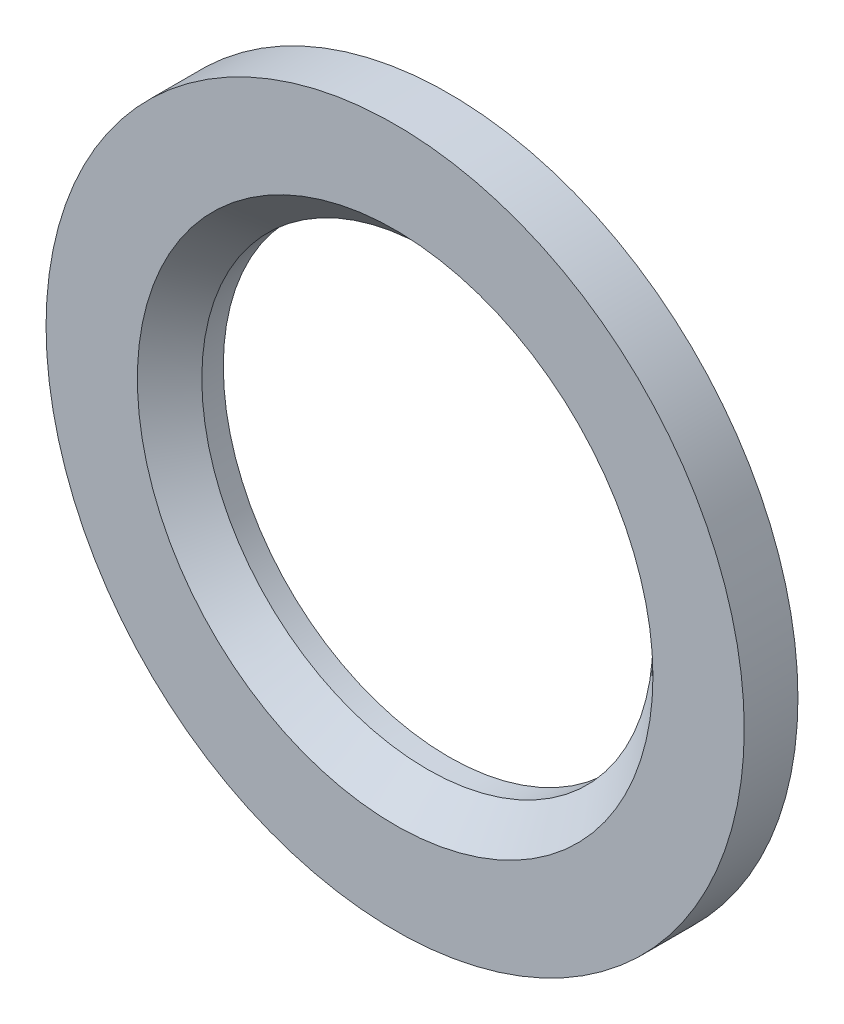
ISO-10303-21;
HEADER;
FILE_DESCRIPTION(('STEP AP214'),'2;1');
FILE_NAME('part.step','',(''),(''),'','','');
FILE_SCHEMA(('AUTOMOTIVE_DESIGN { 1 0 10303 214 1 1 1 1 }'));
ENDSEC;
DATA;
#1=APPLICATION_CONTEXT('core data for automotive mechanical design processes');
#2=APPLICATION_PROTOCOL_DEFINITION('international standard','automotive_design',2000,#1);
#3=PRODUCT_CONTEXT('',#1,'mechanical');
#4=PRODUCT('Part','Part','',(#3));
#5=PRODUCT_RELATED_PRODUCT_CATEGORY('part','',(#4));
#6=PRODUCT_DEFINITION_FORMATION('','',#4);
#7=PRODUCT_DEFINITION_CONTEXT('part definition',#1,'design');
#8=PRODUCT_DEFINITION('design','',#6,#7);
#9=PRODUCT_DEFINITION_SHAPE('','',#8);
#10=(LENGTH_UNIT() NAMED_UNIT(*) SI_UNIT(.MILLI.,.METRE.));
#11=(NAMED_UNIT(*) PLANE_ANGLE_UNIT() SI_UNIT($,.RADIAN.));
#12=(NAMED_UNIT(*) SI_UNIT($,.STERADIAN.) SOLID_ANGLE_UNIT());
#13=UNCERTAINTY_MEASURE_WITH_UNIT(LENGTH_MEASURE(1.E-05),#10,'distance_accuracy_value','');
#14=(GEOMETRIC_REPRESENTATION_CONTEXT(3) GLOBAL_UNCERTAINTY_ASSIGNED_CONTEXT((#13)) GLOBAL_UNIT_ASSIGNED_CONTEXT((#10,
#11,#12)) REPRESENTATION_CONTEXT('',''));
#15=CARTESIAN_POINT('',(0.,0.,0.));
#16=DIRECTION('',(0.,0.,1.));
#17=DIRECTION('',(1.,0.,0.));
#18=AXIS2_PLACEMENT_3D('',#15,#16,#17);
#19=CARTESIAN_POINT('',(0.,0.,1.));
#20=DIRECTION('',(0.,0.,1.));
#21=DIRECTION('',(1.,0.,0.));
#22=AXIS2_PLACEMENT_3D('',#19,#20,#21);
#23=PLANE('',#22);
#24=CARTESIAN_POINT('',(0.,0.,1.));
#25=DIRECTION('',(0.,0.,1.));
#26=DIRECTION('',(1.,0.,0.));
#27=AXIS2_PLACEMENT_3D('',#24,#25,#26);
#28=CIRCLE('',#27,4.8);
#29=CARTESIAN_POINT('',(4.8,0.,1.));
#30=VERTEX_POINT('',#29);
#31=EDGE_CURVE('E10',#30,#30,#28,.F.);
#32=ORIENTED_EDGE('',*,*,#31,.T.);
#33=EDGE_LOOP('',(#32));
#34=FACE_BOUND('',#33,.T.);
#35=CARTESIAN_POINT('',(0.,0.,1.));
#36=DIRECTION('',(0.,0.,1.));
#37=DIRECTION('',(1.,0.,0.));
#38=AXIS2_PLACEMENT_3D('',#35,#36,#37);
#39=CIRCLE('',#38,6.5);
#40=CARTESIAN_POINT('',(6.5,0.,1.));
#41=VERTEX_POINT('',#40);
#42=EDGE_CURVE('E41',#41,#41,#39,.T.);
#43=ORIENTED_EDGE('',*,*,#42,.T.);
#44=EDGE_LOOP('',(#43));
#45=FACE_BOUND('',#44,.T.);
#46=ADVANCED_FACE('F30',(#34,#45),#23,.T.);
#47=CARTESIAN_POINT('',(0.,0.,0.));
#48=DIRECTION('',(0.,0.,1.));
#49=DIRECTION('',(1.,0.,0.));
#50=AXIS2_PLACEMENT_3D('',#47,#48,#49);
#51=PLANE('',#50);
#52=CARTESIAN_POINT('',(0.,0.,0.));
#53=DIRECTION('',(0.,0.,1.));
#54=DIRECTION('',(1.,0.,0.));
#55=AXIS2_PLACEMENT_3D('',#52,#53,#54);
#56=CIRCLE('',#55,6.5);
#57=CARTESIAN_POINT('',(6.5,0.,0.));
#58=VERTEX_POINT('',#57);
#59=EDGE_CURVE('E45',#58,#58,#56,.T.);
#60=ORIENTED_EDGE('',*,*,#59,.F.);
#61=EDGE_LOOP('',(#60));
#62=FACE_BOUND('',#61,.T.);
#63=CARTESIAN_POINT('',(0.,0.,0.));
#64=DIRECTION('',(0.,0.,1.));
#65=DIRECTION('',(1.,0.,0.));
#66=AXIS2_PLACEMENT_3D('',#63,#64,#65);
#67=CIRCLE('',#66,4.2);
#68=CARTESIAN_POINT('',(4.2,0.,0.));
#69=VERTEX_POINT('',#68);
#70=EDGE_CURVE('E49',#69,#69,#67,.T.);
#71=ORIENTED_EDGE('',*,*,#70,.T.);
#72=EDGE_LOOP('',(#71));
#73=FACE_BOUND('',#72,.T.);
#74=ADVANCED_FACE('F54',(#62,#73),#51,.F.);
#75=CARTESIAN_POINT('',(0.,0.,1.));
#76=DIRECTION('',(0.,0.,-1.));
#77=DIRECTION('',(-1.,0.,0.));
#78=AXIS2_PLACEMENT_3D('',#75,#76,#77);
#79=CYLINDRICAL_SURFACE('',#78,6.5);
#80=ORIENTED_EDGE('',*,*,#42,.F.);
#81=EDGE_LOOP('',(#80));
#82=FACE_BOUND('',#81,.T.);
#83=ORIENTED_EDGE('',*,*,#59,.T.);
#84=EDGE_LOOP('',(#83));
#85=FACE_BOUND('',#84,.T.);
#86=ADVANCED_FACE('F58',(#82,#85),#79,.T.);
#87=CARTESIAN_POINT('',(0.,0.,1.));
#88=DIRECTION('',(0.,0.,-1.));
#89=DIRECTION('',(-1.,0.,0.));
#90=AXIS2_PLACEMENT_3D('',#87,#88,#89);
#91=CYLINDRICAL_SURFACE('',#90,4.2);
#92=CARTESIAN_POINT('',(0.,0.,0.400000000000004));
#93=DIRECTION('',(0.,0.,1.));
#94=DIRECTION('',(1.,0.,0.));
#95=AXIS2_PLACEMENT_3D('',#92,#93,#94);
#96=CIRCLE('',#95,4.2);
#97=CARTESIAN_POINT('',(4.2,0.,0.400000000000004));
#98=VERTEX_POINT('',#97);
#99=EDGE_CURVE('E37',#98,#98,#96,.T.);
#100=ORIENTED_EDGE('',*,*,#99,.T.);
#101=EDGE_LOOP('',(#100));
#102=FACE_BOUND('',#101,.T.);
#103=ORIENTED_EDGE('',*,*,#70,.F.);
#104=EDGE_LOOP('',(#103));
#105=FACE_BOUND('',#104,.T.);
#106=ADVANCED_FACE('F56',(#102,#105),#91,.F.);
#107=CARTESIAN_POINT('',(0.,0.,0.400000000000004));
#108=DIRECTION('',(0.,0.,1.));
#109=DIRECTION('',(1.,0.,0.));
#110=AXIS2_PLACEMENT_3D('',#107,#108,#109);
#111=CONICAL_SURFACE('',#110,4.2,0.785398163397453);
#112=ORIENTED_EDGE('',*,*,#31,.F.);
#113=EDGE_LOOP('',(#112));
#114=FACE_BOUND('',#113,.T.);
#115=ORIENTED_EDGE('',*,*,#99,.F.);
#116=EDGE_LOOP('',(#115));
#117=FACE_BOUND('',#116,.T.);
#118=ADVANCED_FACE('F32',(#114,#117),#111,.F.);
#119=CLOSED_SHELL('',(#46,#74,#86,#106,#118));
#120=MANIFOLD_SOLID_BREP('B2',#119);
#121=ADVANCED_BREP_SHAPE_REPRESENTATION('',(#18,#120),#14);
#122=SHAPE_DEFINITION_REPRESENTATION(#9,#121);
ENDSEC;
END-ISO-10303-21;
